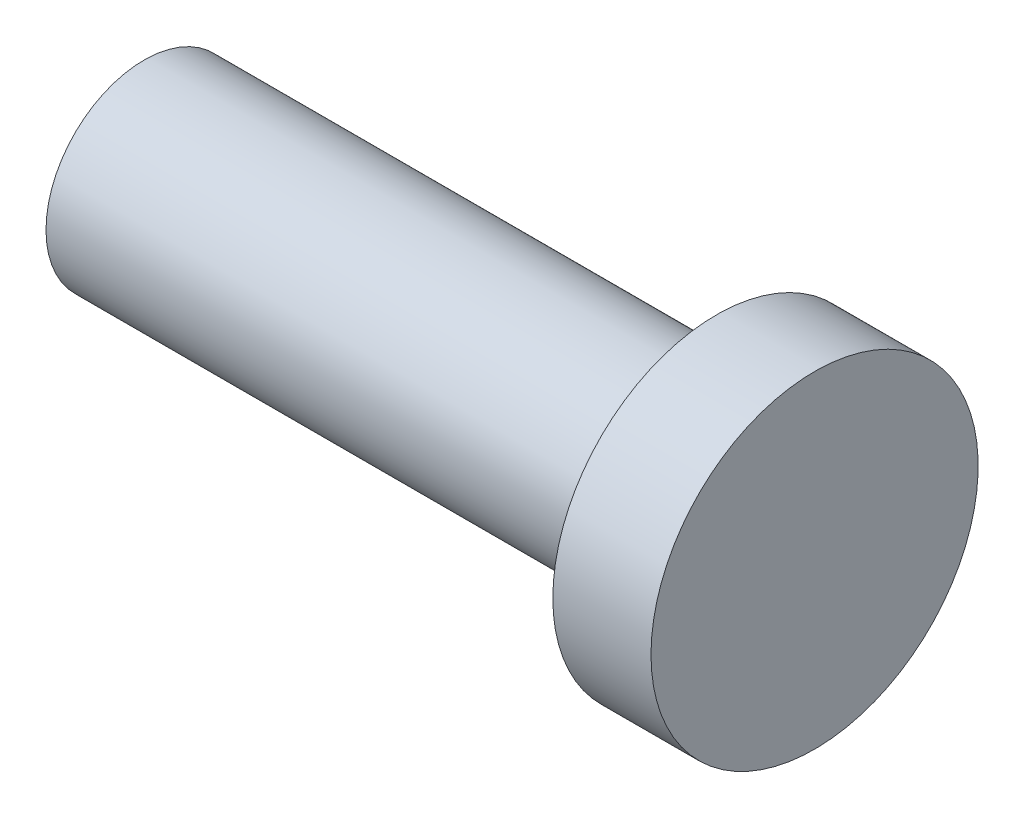
ISO-10303-21;
HEADER;
FILE_DESCRIPTION(('STEP AP214'),'2;1');
FILE_NAME('part.step','',(''),(''),'','','');
FILE_SCHEMA(('AUTOMOTIVE_DESIGN { 1 0 10303 214 1 1 1 1 }'));
ENDSEC;
DATA;
#1=APPLICATION_CONTEXT('core data for automotive mechanical design processes');
#2=APPLICATION_PROTOCOL_DEFINITION('international standard','automotive_design',2000,#1);
#3=PRODUCT_CONTEXT('',#1,'mechanical');
#4=PRODUCT('Part','Part','',(#3));
#5=PRODUCT_RELATED_PRODUCT_CATEGORY('part','',(#4));
#6=PRODUCT_DEFINITION_FORMATION('','',#4);
#7=PRODUCT_DEFINITION_CONTEXT('part definition',#1,'design');
#8=PRODUCT_DEFINITION('design','',#6,#7);
#9=PRODUCT_DEFINITION_SHAPE('','',#8);
#10=(LENGTH_UNIT() NAMED_UNIT(*) SI_UNIT(.MILLI.,.METRE.));
#11=(NAMED_UNIT(*) PLANE_ANGLE_UNIT() SI_UNIT($,.RADIAN.));
#12=(NAMED_UNIT(*) SI_UNIT($,.STERADIAN.) SOLID_ANGLE_UNIT());
#13=UNCERTAINTY_MEASURE_WITH_UNIT(LENGTH_MEASURE(1.E-05),#10,'distance_accuracy_value','');
#14=(GEOMETRIC_REPRESENTATION_CONTEXT(3) GLOBAL_UNCERTAINTY_ASSIGNED_CONTEXT((#13)) GLOBAL_UNIT_ASSIGNED_CONTEXT((#10,
#11,#12)) REPRESENTATION_CONTEXT('',''));
#15=CARTESIAN_POINT('',(0.,0.,0.));
#16=DIRECTION('',(0.,0.,1.));
#17=DIRECTION('',(1.,0.,0.));
#18=AXIS2_PLACEMENT_3D('',#15,#16,#17);
#19=CARTESIAN_POINT('',(0.,0.,0.));
#20=DIRECTION('',(-1.,0.,0.));
#21=DIRECTION('',(0.,0.,1.));
#22=AXIS2_PLACEMENT_3D('',#19,#20,#21);
#23=PLANE('',#22);
#24=CARTESIAN_POINT('',(0.,0.,0.));
#25=DIRECTION('',(-1.,0.,0.));
#26=DIRECTION('',(0.,0.,1.));
#27=AXIS2_PLACEMENT_3D('',#24,#25,#26);
#28=CIRCLE('',#27,2.5);
#29=CARTESIAN_POINT('',(0.,0.,2.5));
#30=VERTEX_POINT('',#29);
#31=EDGE_CURVE('E10',#30,#30,#28,.T.);
#32=ORIENTED_EDGE('',*,*,#31,.F.);
#33=EDGE_LOOP('',(#32));
#34=FACE_BOUND('',#33,.T.);
#35=ADVANCED_FACE('F43',(#34),#23,.F.);
#36=CARTESIAN_POINT('',(-42.2102321032405,0.,0.));
#37=DIRECTION('',(-1.,0.,0.));
#38=DIRECTION('',(0.,0.,1.));
#39=AXIS2_PLACEMENT_3D('',#36,#37,#38);
#40=CYLINDRICAL_SURFACE('',#39,2.5);
#41=CARTESIAN_POINT('',(-1.5,0.,0.));
#42=DIRECTION('',(-1.,0.,0.));
#43=DIRECTION('',(0.,0.,1.));
#44=AXIS2_PLACEMENT_3D('',#41,#42,#43);
#45=CIRCLE('',#44,2.5);
#46=CARTESIAN_POINT('',(-1.5,0.,2.5));
#47=VERTEX_POINT('',#46);
#48=EDGE_CURVE('E50',#47,#47,#45,.T.);
#49=ORIENTED_EDGE('',*,*,#48,.F.);
#50=EDGE_LOOP('',(#49));
#51=FACE_BOUND('',#50,.T.);
#52=ORIENTED_EDGE('',*,*,#31,.T.);
#53=EDGE_LOOP('',(#52));
#54=FACE_BOUND('',#53,.T.);
#55=ADVANCED_FACE('F77',(#51,#54),#40,.T.);
#56=CARTESIAN_POINT('',(-1.5,0.,-2.5));
#57=DIRECTION('',(1.,0.,0.));
#58=DIRECTION('',(0.,0.,-1.));
#59=AXIS2_PLACEMENT_3D('',#56,#57,#58);
#60=PLANE('',#59);
#61=CARTESIAN_POINT('',(-1.5,0.,0.));
#62=DIRECTION('',(-1.,0.,0.));
#63=DIRECTION('',(0.,0.,1.));
#64=AXIS2_PLACEMENT_3D('',#61,#62,#63);
#65=CIRCLE('',#64,1.5);
#66=CARTESIAN_POINT('',(-1.5,0.,1.5));
#67=VERTEX_POINT('',#66);
#68=EDGE_CURVE('E55',#67,#67,#65,.T.);
#69=ORIENTED_EDGE('',*,*,#68,.F.);
#70=EDGE_LOOP('',(#69));
#71=FACE_BOUND('',#70,.T.);
#72=ORIENTED_EDGE('',*,*,#48,.T.);
#73=EDGE_LOOP('',(#72));
#74=FACE_BOUND('',#73,.T.);
#75=ADVANCED_FACE('F72',(#71,#74),#60,.F.);
#76=CARTESIAN_POINT('',(-42.2102321032405,0.,0.));
#77=DIRECTION('',(-1.,0.,0.));
#78=DIRECTION('',(0.,0.,1.));
#79=AXIS2_PLACEMENT_3D('',#76,#77,#78);
#80=CYLINDRICAL_SURFACE('',#79,1.5);
#81=CARTESIAN_POINT('',(-10.2454831658277,0.,0.));
#82=DIRECTION('',(-1.,0.,0.));
#83=DIRECTION('',(0.,0.,1.));
#84=AXIS2_PLACEMENT_3D('',#81,#82,#83);
#85=CIRCLE('',#84,1.5);
#86=CARTESIAN_POINT('',(-10.2454831658277,0.,1.5));
#87=VERTEX_POINT('',#86);
#88=EDGE_CURVE('E60',#87,#87,#85,.T.);
#89=ORIENTED_EDGE('',*,*,#88,.F.);
#90=EDGE_LOOP('',(#89));
#91=FACE_BOUND('',#90,.T.);
#92=ORIENTED_EDGE('',*,*,#68,.T.);
#93=EDGE_LOOP('',(#92));
#94=FACE_BOUND('',#93,.T.);
#95=ADVANCED_FACE('F69',(#91,#94),#80,.T.);
#96=CARTESIAN_POINT('',(-10.2454831658277,0.,-1.5));
#97=DIRECTION('',(1.,0.,0.));
#98=DIRECTION('',(0.,0.,-1.));
#99=AXIS2_PLACEMENT_3D('',#96,#97,#98);
#100=PLANE('',#99);
#101=ORIENTED_EDGE('',*,*,#88,.T.);
#102=EDGE_LOOP('',(#101));
#103=FACE_BOUND('',#102,.T.);
#104=ADVANCED_FACE('F67',(#103),#100,.F.);
#105=CLOSED_SHELL('',(#35,#55,#75,#95,#104));
#106=MANIFOLD_SOLID_BREP('B2',#105);
#107=ADVANCED_BREP_SHAPE_REPRESENTATION('',(#18,#106),#14);
#108=SHAPE_DEFINITION_REPRESENTATION(#9,#107);
ENDSEC;
END-ISO-10303-21;
